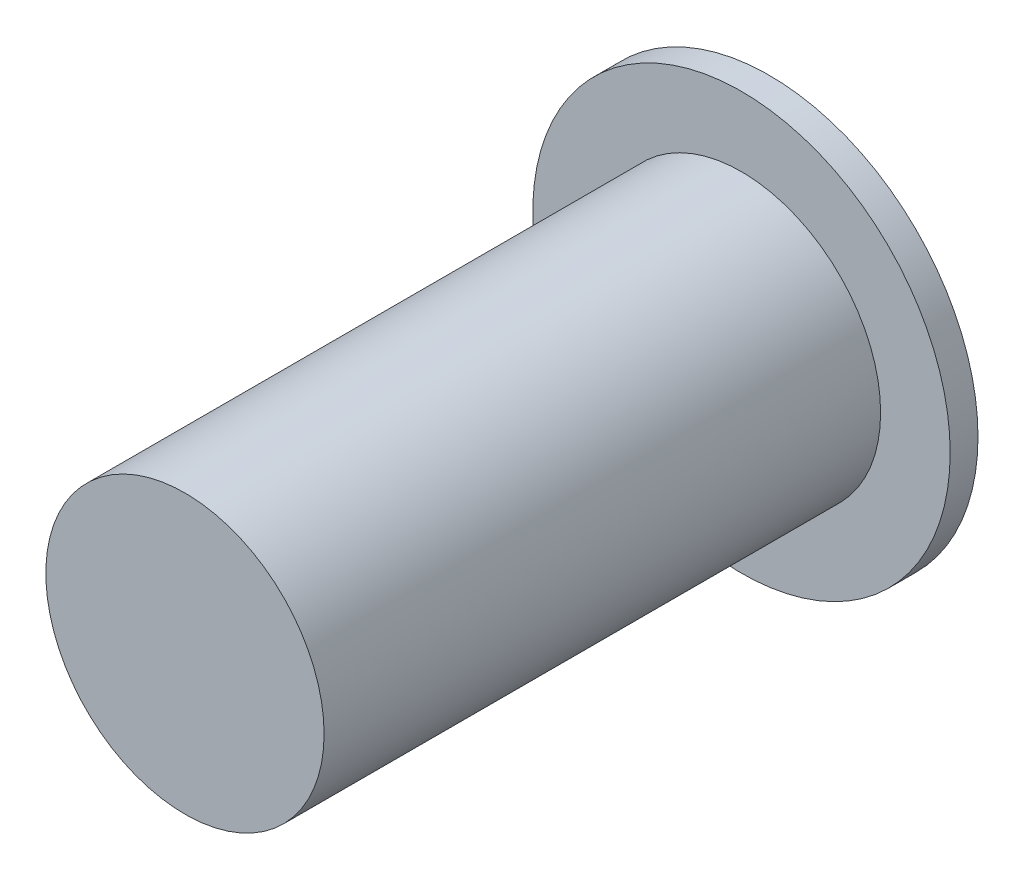
ISO-10303-21;
HEADER;
FILE_DESCRIPTION(('STEP AP214'),'2;1');
FILE_NAME('part.step','',(''),(''),'','','');
FILE_SCHEMA(('AUTOMOTIVE_DESIGN { 1 0 10303 214 1 1 1 1 }'));
ENDSEC;
DATA;
#1=APPLICATION_CONTEXT('core data for automotive mechanical design processes');
#2=APPLICATION_PROTOCOL_DEFINITION('international standard','automotive_design',2000,#1);
#3=PRODUCT_CONTEXT('',#1,'mechanical');
#4=PRODUCT('Part','Part','',(#3));
#5=PRODUCT_RELATED_PRODUCT_CATEGORY('part','',(#4));
#6=PRODUCT_DEFINITION_FORMATION('','',#4);
#7=PRODUCT_DEFINITION_CONTEXT('part definition',#1,'design');
#8=PRODUCT_DEFINITION('design','',#6,#7);
#9=PRODUCT_DEFINITION_SHAPE('','',#8);
#10=(LENGTH_UNIT() NAMED_UNIT(*) SI_UNIT(.MILLI.,.METRE.));
#11=(NAMED_UNIT(*) PLANE_ANGLE_UNIT() SI_UNIT($,.RADIAN.));
#12=(NAMED_UNIT(*) SI_UNIT($,.STERADIAN.) SOLID_ANGLE_UNIT());
#13=UNCERTAINTY_MEASURE_WITH_UNIT(LENGTH_MEASURE(1.E-05),#10,'distance_accuracy_value','');
#14=(GEOMETRIC_REPRESENTATION_CONTEXT(3) GLOBAL_UNCERTAINTY_ASSIGNED_CONTEXT((#13)) GLOBAL_UNIT_ASSIGNED_CONTEXT((#10,
#11,#12)) REPRESENTATION_CONTEXT('',''));
#15=CARTESIAN_POINT('',(0.,0.,0.));
#16=DIRECTION('',(0.,0.,1.));
#17=DIRECTION('',(1.,0.,0.));
#18=AXIS2_PLACEMENT_3D('',#15,#16,#17);
#19=CARTESIAN_POINT('',(0.,0.,0.1));
#20=DIRECTION('',(0.,0.,1.));
#21=DIRECTION('',(1.,0.,0.));
#22=AXIS2_PLACEMENT_3D('',#19,#20,#21);
#23=PLANE('',#22);
#24=CARTESIAN_POINT('',(0.,0.,0.1));
#25=DIRECTION('',(0.,0.,1.));
#26=DIRECTION('',(1.,0.,0.));
#27=AXIS2_PLACEMENT_3D('',#24,#25,#26);
#28=CIRCLE('',#27,0.750000000000001);
#29=CARTESIAN_POINT('',(0.750000000000001,0.,0.1));
#30=VERTEX_POINT('',#29);
#31=EDGE_CURVE('E10',#30,#30,#28,.T.);
#32=ORIENTED_EDGE('',*,*,#31,.T.);
#33=EDGE_LOOP('',(#32));
#34=FACE_BOUND('',#33,.T.);
#35=CARTESIAN_POINT('',(0.,0.,0.1));
#36=DIRECTION('',(0.,0.,1.));
#37=DIRECTION('',(1.,0.,0.));
#38=AXIS2_PLACEMENT_3D('',#35,#36,#37);
#39=CIRCLE('',#38,0.5);
#40=CARTESIAN_POINT('',(0.5,0.,0.1));
#41=VERTEX_POINT('',#40);
#42=EDGE_CURVE('E43',#41,#41,#39,.T.);
#43=ORIENTED_EDGE('',*,*,#42,.F.);
#44=EDGE_LOOP('',(#43));
#45=FACE_BOUND('',#44,.T.);
#46=ADVANCED_FACE('F30',(#34,#45),#23,.T.);
#47=CARTESIAN_POINT('',(0.,0.,0.1));
#48=DIRECTION('',(0.,0.,-1.));
#49=DIRECTION('',(-1.,0.,0.));
#50=AXIS2_PLACEMENT_3D('',#47,#48,#49);
#51=CYLINDRICAL_SURFACE('',#50,0.750000000000001);
#52=ORIENTED_EDGE('',*,*,#31,.F.);
#53=EDGE_LOOP('',(#52));
#54=FACE_BOUND('',#53,.T.);
#55=CARTESIAN_POINT('',(0.,0.,0.));
#56=DIRECTION('',(0.,0.,1.));
#57=DIRECTION('',(1.,0.,0.));
#58=AXIS2_PLACEMENT_3D('',#55,#56,#57);
#59=CIRCLE('',#58,0.750000000000001);
#60=CARTESIAN_POINT('',(0.750000000000001,0.,0.));
#61=VERTEX_POINT('',#60);
#62=EDGE_CURVE('E34',#61,#61,#59,.T.);
#63=ORIENTED_EDGE('',*,*,#62,.T.);
#64=EDGE_LOOP('',(#63));
#65=FACE_BOUND('',#64,.T.);
#66=ADVANCED_FACE('F32',(#54,#65),#51,.T.);
#67=CARTESIAN_POINT('',(0.,0.,0.));
#68=DIRECTION('',(0.,0.,1.));
#69=DIRECTION('',(1.,0.,0.));
#70=AXIS2_PLACEMENT_3D('',#67,#68,#69);
#71=PLANE('',#70);
#72=ORIENTED_EDGE('',*,*,#62,.F.);
#73=EDGE_LOOP('',(#72));
#74=FACE_BOUND('',#73,.T.);
#75=ADVANCED_FACE('F54',(#74),#71,.F.);
#76=CARTESIAN_POINT('',(0.,0.,2.1));
#77=DIRECTION('',(0.,0.,-1.));
#78=DIRECTION('',(-1.,0.,0.));
#79=AXIS2_PLACEMENT_3D('',#76,#77,#78);
#80=CYLINDRICAL_SURFACE('',#79,0.5);
#81=CARTESIAN_POINT('',(0.,0.,2.1));
#82=DIRECTION('',(0.,0.,1.));
#83=DIRECTION('',(1.,0.,0.));
#84=AXIS2_PLACEMENT_3D('',#81,#82,#83);
#85=CIRCLE('',#84,0.5);
#86=CARTESIAN_POINT('',(0.5,0.,2.1));
#87=VERTEX_POINT('',#86);
#88=EDGE_CURVE('E41',#87,#87,#85,.T.);
#89=ORIENTED_EDGE('',*,*,#88,.F.);
#90=EDGE_LOOP('',(#89));
#91=FACE_BOUND('',#90,.T.);
#92=ORIENTED_EDGE('',*,*,#42,.T.);
#93=EDGE_LOOP('',(#92));
#94=FACE_BOUND('',#93,.T.);
#95=ADVANCED_FACE('F51',(#91,#94),#80,.T.);
#96=CARTESIAN_POINT('',(0.,0.,2.1));
#97=DIRECTION('',(0.,0.,1.));
#98=DIRECTION('',(1.,0.,0.));
#99=AXIS2_PLACEMENT_3D('',#96,#97,#98);
#100=PLANE('',#99);
#101=ORIENTED_EDGE('',*,*,#88,.T.);
#102=EDGE_LOOP('',(#101));
#103=FACE_BOUND('',#102,.T.);
#104=ADVANCED_FACE('F49',(#103),#100,.T.);
#105=CLOSED_SHELL('',(#46,#66,#75,#95,#104));
#106=MANIFOLD_SOLID_BREP('B2',#105);
#107=ADVANCED_BREP_SHAPE_REPRESENTATION('',(#18,#106),#14);
#108=SHAPE_DEFINITION_REPRESENTATION(#9,#107);
ENDSEC;
END-ISO-10303-21;
